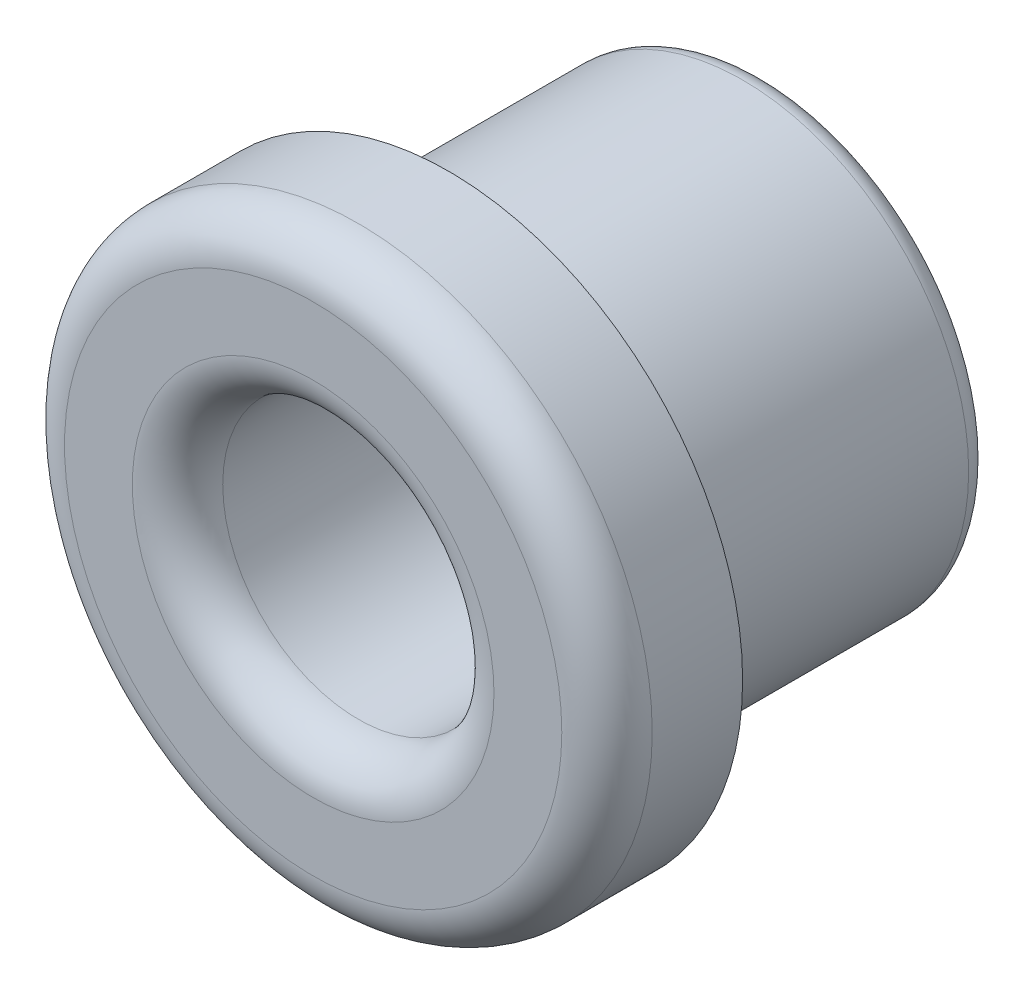
ISO-10303-21;
HEADER;
FILE_DESCRIPTION(('STEP AP214'),'2;1');
FILE_NAME('part.step','',(''),(''),'','','');
FILE_SCHEMA(('AUTOMOTIVE_DESIGN { 1 0 10303 214 1 1 1 1 }'));
ENDSEC;
DATA;
#1=APPLICATION_CONTEXT('core data for automotive mechanical design processes');
#2=APPLICATION_PROTOCOL_DEFINITION('international standard','automotive_design',2000,#1);
#3=PRODUCT_CONTEXT('',#1,'mechanical');
#4=PRODUCT('Part','Part','',(#3));
#5=PRODUCT_RELATED_PRODUCT_CATEGORY('part','',(#4));
#6=PRODUCT_DEFINITION_FORMATION('','',#4);
#7=PRODUCT_DEFINITION_CONTEXT('part definition',#1,'design');
#8=PRODUCT_DEFINITION('design','',#6,#7);
#9=PRODUCT_DEFINITION_SHAPE('','',#8);
#10=(LENGTH_UNIT() NAMED_UNIT(*) SI_UNIT(.MILLI.,.METRE.));
#11=(NAMED_UNIT(*) PLANE_ANGLE_UNIT() SI_UNIT($,.RADIAN.));
#12=(NAMED_UNIT(*) SI_UNIT($,.STERADIAN.) SOLID_ANGLE_UNIT());
#13=UNCERTAINTY_MEASURE_WITH_UNIT(LENGTH_MEASURE(1.E-05),#10,'distance_accuracy_value','');
#14=(GEOMETRIC_REPRESENTATION_CONTEXT(3) GLOBAL_UNCERTAINTY_ASSIGNED_CONTEXT((#13)) GLOBAL_UNIT_ASSIGNED_CONTEXT((#10,
#11,#12)) REPRESENTATION_CONTEXT('',''));
#15=CARTESIAN_POINT('',(0.,0.,0.));
#16=DIRECTION('',(0.,0.,1.));
#17=DIRECTION('',(1.,0.,0.));
#18=AXIS2_PLACEMENT_3D('',#15,#16,#17);
#19=CARTESIAN_POINT('',(0.,0.,0.));
#20=DIRECTION('',(0.,0.,1.));
#21=DIRECTION('',(1.,0.,0.));
#22=AXIS2_PLACEMENT_3D('',#19,#20,#21);
#23=PLANE('',#22);
#24=CARTESIAN_POINT('',(0.,0.,0.));
#25=DIRECTION('',(0.,0.,1.));
#26=DIRECTION('',(1.,0.,0.));
#27=AXIS2_PLACEMENT_3D('',#24,#25,#26);
#28=CIRCLE('',#27,4.5);
#29=CARTESIAN_POINT('',(4.5,0.,0.));
#30=VERTEX_POINT('',#29);
#31=EDGE_CURVE('E10',#30,#30,#28,.F.);
#32=ORIENTED_EDGE('',*,*,#31,.T.);
#33=EDGE_LOOP('',(#32));
#34=FACE_BOUND('',#33,.T.);
#35=CARTESIAN_POINT('',(0.,0.,0.));
#36=DIRECTION('',(0.,0.,1.));
#37=DIRECTION('',(1.,0.,0.));
#38=AXIS2_PLACEMENT_3D('',#35,#36,#37);
#39=CIRCLE('',#38,3.);
#40=CARTESIAN_POINT('',(3.,0.,0.));
#41=VERTEX_POINT('',#40);
#42=EDGE_CURVE('E61',#41,#41,#39,.T.);
#43=ORIENTED_EDGE('',*,*,#42,.T.);
#44=EDGE_LOOP('',(#43));
#45=FACE_BOUND('',#44,.T.);
#46=ADVANCED_FACE('F32',(#34,#45),#23,.F.);
#47=CARTESIAN_POINT('',(0.,0.,7.));
#48=DIRECTION('',(0.,0.,-1.));
#49=DIRECTION('',(-1.,0.,0.));
#50=AXIS2_PLACEMENT_3D('',#47,#48,#49);
#51=CYLINDRICAL_SURFACE('',#50,5.);
#52=CARTESIAN_POINT('',(0.,0.,0.5));
#53=DIRECTION('',(0.,0.,1.));
#54=DIRECTION('',(1.,0.,0.));
#55=AXIS2_PLACEMENT_3D('',#52,#53,#54);
#56=CIRCLE('',#55,5.);
#57=CARTESIAN_POINT('',(5.,0.,0.5));
#58=VERTEX_POINT('',#57);
#59=EDGE_CURVE('E39',#58,#58,#56,.T.);
#60=ORIENTED_EDGE('',*,*,#59,.T.);
#61=EDGE_LOOP('',(#60));
#62=FACE_BOUND('',#61,.T.);
#63=CARTESIAN_POINT('',(0.,0.,7.));
#64=DIRECTION('',(0.,0.,1.));
#65=DIRECTION('',(1.,0.,0.));
#66=AXIS2_PLACEMENT_3D('',#63,#64,#65);
#67=CIRCLE('',#66,5.);
#68=CARTESIAN_POINT('',(5.,0.,7.));
#69=VERTEX_POINT('',#68);
#70=EDGE_CURVE('E58',#69,#69,#67,.T.);
#71=ORIENTED_EDGE('',*,*,#70,.F.);
#72=EDGE_LOOP('',(#71));
#73=FACE_BOUND('',#72,.T.);
#74=ADVANCED_FACE('F86',(#62,#73),#51,.T.);
#75=CARTESIAN_POINT('',(0.,0.,7.));
#76=DIRECTION('',(0.,0.,-1.));
#77=DIRECTION('',(-1.,0.,0.));
#78=AXIS2_PLACEMENT_3D('',#75,#76,#77);
#79=CYLINDRICAL_SURFACE('',#78,3.);
#80=CARTESIAN_POINT('',(0.,0.,9.));
#81=DIRECTION('',(0.,0.,1.));
#82=DIRECTION('',(1.,0.,0.));
#83=AXIS2_PLACEMENT_3D('',#80,#81,#82);
#84=CIRCLE('',#83,3.);
#85=CARTESIAN_POINT('',(3.,0.,9.));
#86=VERTEX_POINT('',#85);
#87=EDGE_CURVE('E55',#86,#86,#84,.T.);
#88=ORIENTED_EDGE('',*,*,#87,.T.);
#89=EDGE_LOOP('',(#88));
#90=FACE_BOUND('',#89,.T.);
#91=ORIENTED_EDGE('',*,*,#42,.F.);
#92=EDGE_LOOP('',(#91));
#93=FACE_BOUND('',#92,.T.);
#94=ADVANCED_FACE('F82',(#90,#93),#79,.F.);
#95=CARTESIAN_POINT('',(0.,0.,10.));
#96=DIRECTION('',(0.,0.,1.));
#97=DIRECTION('',(1.,0.,0.));
#98=AXIS2_PLACEMENT_3D('',#95,#96,#97);
#99=PLANE('',#98);
#100=CARTESIAN_POINT('',(0.,0.,10.));
#101=DIRECTION('',(0.,0.,1.));
#102=DIRECTION('',(1.,0.,0.));
#103=AXIS2_PLACEMENT_3D('',#100,#101,#102);
#104=CIRCLE('',#103,4.);
#105=CARTESIAN_POINT('',(4.,0.,10.));
#106=VERTEX_POINT('',#105);
#107=EDGE_CURVE('E47',#106,#106,#104,.F.);
#108=ORIENTED_EDGE('',*,*,#107,.T.);
#109=EDGE_LOOP('',(#108));
#110=FACE_BOUND('',#109,.T.);
#111=CARTESIAN_POINT('',(0.,0.,10.));
#112=DIRECTION('',(0.,0.,1.));
#113=DIRECTION('',(1.,0.,0.));
#114=AXIS2_PLACEMENT_3D('',#111,#112,#113);
#115=CIRCLE('',#114,5.5);
#116=CARTESIAN_POINT('',(5.5,0.,10.));
#117=VERTEX_POINT('',#116);
#118=EDGE_CURVE('E52',#117,#117,#115,.T.);
#119=ORIENTED_EDGE('',*,*,#118,.T.);
#120=EDGE_LOOP('',(#119));
#121=FACE_BOUND('',#120,.T.);
#122=ADVANCED_FACE('F72',(#110,#121),#99,.T.);
#123=CARTESIAN_POINT('',(0.,0.,7.));
#124=DIRECTION('',(0.,0.,1.));
#125=DIRECTION('',(1.,0.,0.));
#126=AXIS2_PLACEMENT_3D('',#123,#124,#125);
#127=PLANE('',#126);
#128=ORIENTED_EDGE('',*,*,#70,.T.);
#129=EDGE_LOOP('',(#128));
#130=FACE_BOUND('',#129,.T.);
#131=CARTESIAN_POINT('',(0.,0.,7.));
#132=DIRECTION('',(0.,0.,1.));
#133=DIRECTION('',(1.,0.,0.));
#134=AXIS2_PLACEMENT_3D('',#131,#132,#133);
#135=CIRCLE('',#134,6.5);
#136=CARTESIAN_POINT('',(6.5,0.,7.));
#137=VERTEX_POINT('',#136);
#138=EDGE_CURVE('E64',#137,#137,#135,.T.);
#139=ORIENTED_EDGE('',*,*,#138,.F.);
#140=EDGE_LOOP('',(#139));
#141=FACE_BOUND('',#140,.T.);
#142=ADVANCED_FACE('F70',(#130,#141),#127,.F.);
#143=CARTESIAN_POINT('',(0.,0.,10.));
#144=DIRECTION('',(0.,0.,-1.));
#145=DIRECTION('',(-1.,0.,0.));
#146=AXIS2_PLACEMENT_3D('',#143,#144,#145);
#147=CYLINDRICAL_SURFACE('',#146,6.5);
#148=CARTESIAN_POINT('',(0.,0.,9.));
#149=DIRECTION('',(0.,0.,1.));
#150=DIRECTION('',(1.,0.,0.));
#151=AXIS2_PLACEMENT_3D('',#148,#149,#150);
#152=CIRCLE('',#151,6.5);
#153=CARTESIAN_POINT('',(6.5,0.,9.));
#154=VERTEX_POINT('',#153);
#155=EDGE_CURVE('E43',#154,#154,#152,.F.);
#156=ORIENTED_EDGE('',*,*,#155,.T.);
#157=EDGE_LOOP('',(#156));
#158=FACE_BOUND('',#157,.T.);
#159=ORIENTED_EDGE('',*,*,#138,.T.);
#160=EDGE_LOOP('',(#159));
#161=FACE_BOUND('',#160,.T.);
#162=ADVANCED_FACE('F68',(#158,#161),#147,.T.);
#163=CARTESIAN_POINT('',(0.,0.,9.));
#164=DIRECTION('',(0.,0.,1.));
#165=DIRECTION('',(1.,0.,0.));
#166=AXIS2_PLACEMENT_3D('',#163,#164,#165);
#167=TOROIDAL_SURFACE('',#166,4.,1.);
#168=ORIENTED_EDGE('',*,*,#107,.F.);
#169=EDGE_LOOP('',(#168));
#170=FACE_BOUND('',#169,.T.);
#171=ORIENTED_EDGE('',*,*,#87,.F.);
#172=EDGE_LOOP('',(#171));
#173=FACE_BOUND('',#172,.T.);
#174=ADVANCED_FACE('F79',(#170,#173),#167,.T.);
#175=CARTESIAN_POINT('',(0.,0.,9.));
#176=DIRECTION('',(0.,0.,1.));
#177=DIRECTION('',(1.,0.,0.));
#178=AXIS2_PLACEMENT_3D('',#175,#176,#177);
#179=TOROIDAL_SURFACE('',#178,5.5,1.);
#180=ORIENTED_EDGE('',*,*,#155,.F.);
#181=EDGE_LOOP('',(#180));
#182=FACE_BOUND('',#181,.T.);
#183=ORIENTED_EDGE('',*,*,#118,.F.);
#184=EDGE_LOOP('',(#183));
#185=FACE_BOUND('',#184,.T.);
#186=ADVANCED_FACE('F96',(#182,#185),#179,.T.);
#187=CARTESIAN_POINT('',(0.,0.,0.5));
#188=DIRECTION('',(0.,0.,1.));
#189=DIRECTION('',(1.,0.,0.));
#190=AXIS2_PLACEMENT_3D('',#187,#188,#189);
#191=TOROIDAL_SURFACE('',#190,4.5,0.5);
#192=ORIENTED_EDGE('',*,*,#31,.F.);
#193=EDGE_LOOP('',(#192));
#194=FACE_BOUND('',#193,.T.);
#195=ORIENTED_EDGE('',*,*,#59,.F.);
#196=EDGE_LOOP('',(#195));
#197=FACE_BOUND('',#196,.T.);
#198=ADVANCED_FACE('F34',(#194,#197),#191,.T.);
#199=CLOSED_SHELL('',(#46,#74,#94,#122,#142,#162,#174,#186,#198));
#200=MANIFOLD_SOLID_BREP('B2',#199);
#201=ADVANCED_BREP_SHAPE_REPRESENTATION('',(#18,#200),#14);
#202=SHAPE_DEFINITION_REPRESENTATION(#9,#201);
ENDSEC;
END-ISO-10303-21;
